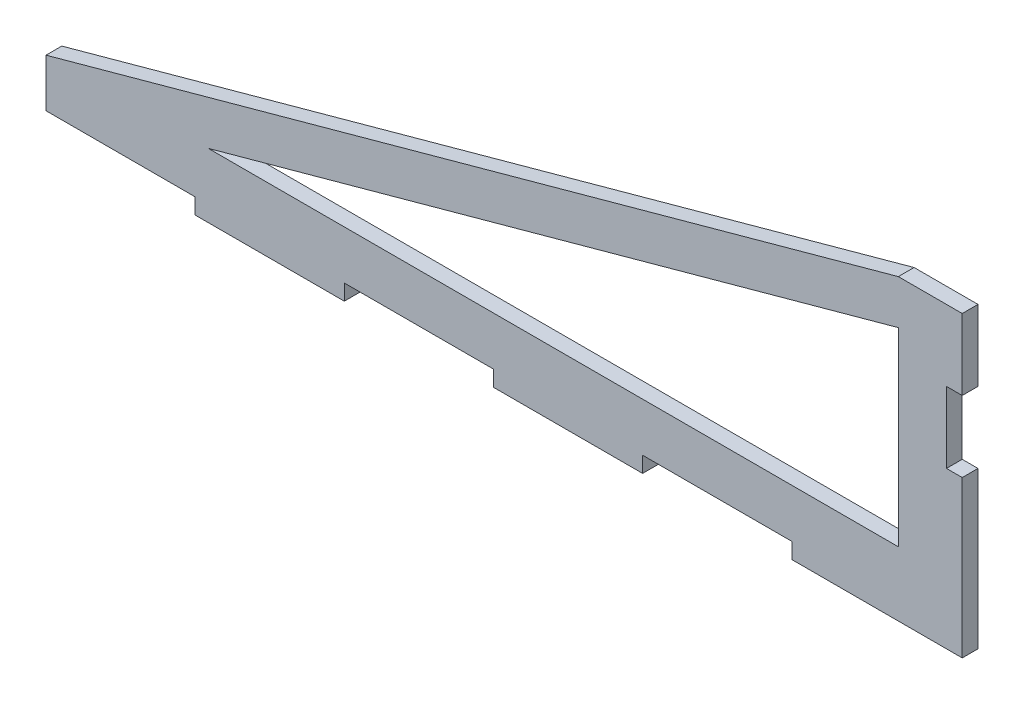
ISO-10303-21;
HEADER;
FILE_DESCRIPTION(('STEP AP214'),'2;1');
FILE_NAME('part.step','',(''),(''),'','','');
FILE_SCHEMA(('AUTOMOTIVE_DESIGN { 1 0 10303 214 1 1 1 1 }'));
ENDSEC;
DATA;
#1=APPLICATION_CONTEXT('core data for automotive mechanical design processes');
#2=APPLICATION_PROTOCOL_DEFINITION('international standard','automotive_design',2000,#1);
#3=PRODUCT_CONTEXT('',#1,'mechanical');
#4=PRODUCT('Part','Part','',(#3));
#5=PRODUCT_RELATED_PRODUCT_CATEGORY('part','',(#4));
#6=PRODUCT_DEFINITION_FORMATION('','',#4);
#7=PRODUCT_DEFINITION_CONTEXT('part definition',#1,'design');
#8=PRODUCT_DEFINITION('design','',#6,#7);
#9=PRODUCT_DEFINITION_SHAPE('','',#8);
#10=(LENGTH_UNIT() NAMED_UNIT(*) SI_UNIT(.MILLI.,.METRE.));
#11=(NAMED_UNIT(*) PLANE_ANGLE_UNIT() SI_UNIT($,.RADIAN.));
#12=(NAMED_UNIT(*) SI_UNIT($,.STERADIAN.) SOLID_ANGLE_UNIT());
#13=UNCERTAINTY_MEASURE_WITH_UNIT(LENGTH_MEASURE(1.E-05),#10,'distance_accuracy_value','');
#14=(GEOMETRIC_REPRESENTATION_CONTEXT(3) GLOBAL_UNCERTAINTY_ASSIGNED_CONTEXT((#13)) GLOBAL_UNIT_ASSIGNED_CONTEXT((#10,
#11,#12)) REPRESENTATION_CONTEXT('',''));
#15=CARTESIAN_POINT('',(0.,0.,0.));
#16=DIRECTION('',(0.,0.,1.));
#17=DIRECTION('',(1.,0.,0.));
#18=AXIS2_PLACEMENT_3D('',#15,#16,#17);
#19=CARTESIAN_POINT('',(0.,0.,4.699));
#20=DIRECTION('',(0.,0.,-1.));
#21=DIRECTION('',(-1.,0.,0.));
#22=AXIS2_PLACEMENT_3D('',#19,#20,#21);
#23=PLANE('',#22);
#24=DIRECTION('',(0.,1.,0.));
#25=VECTOR('',#24,1.);
#26=CARTESIAN_POINT('',(253.999970906423,19.1715711162676,4.699));
#27=LINE('',#26,#25);
#28=CARTESIAN_POINT('',(253.999970906423,19.1715711162676,4.699));
#29=VERTEX_POINT('',#28);
#30=CARTESIAN_POINT('',(253.999970906423,75.7285323883685,4.699));
#31=VERTEX_POINT('',#30);
#32=EDGE_CURVE('E278',#29,#31,#27,.T.);
#33=ORIENTED_EDGE('',*,*,#32,.F.);
#34=DIRECTION('',(1.,0.,0.));
#35=VECTOR('',#34,1.);
#36=CARTESIAN_POINT('',(48.3383171101548,19.1715711162676,4.699));
#37=LINE('',#36,#35);
#38=CARTESIAN_POINT('',(48.3383171101548,19.1715711162676,4.699));
#39=VERTEX_POINT('',#38);
#40=EDGE_CURVE('E284',#39,#29,#37,.T.);
#41=ORIENTED_EDGE('',*,*,#40,.F.);
#42=DIRECTION('',(-0.964205385038861,-0.265156511257149,0.));
#43=VECTOR('',#42,1.);
#44=CARTESIAN_POINT('',(48.3383171101548,19.1715711162676,4.699));
#45=LINE('',#44,#43);
#46=EDGE_CURVE('E280',#31,#39,#45,.T.);
#47=ORIENTED_EDGE('',*,*,#46,.F.);
#48=EDGE_LOOP('',(#33,#41,#47));
#49=FACE_BOUND('',#48,.T.);
#50=DIRECTION('',(1.,0.,0.));
#51=VECTOR('',#50,1.);
#52=CARTESIAN_POINT('',(268.350970906423,46.5666666666666,4.69899999999999));
#53=LINE('',#52,#51);
#54=CARTESIAN_POINT('',(268.350970906423,46.5666666666666,4.69899999999999));
#55=VERTEX_POINT('',#54);
#56=CARTESIAN_POINT('',(273.049970906423,46.5666666666666,4.69899999999999));
#57=VERTEX_POINT('',#56);
#58=EDGE_CURVE('E193',#55,#57,#53,.T.);
#59=ORIENTED_EDGE('',*,*,#58,.F.);
#60=DIRECTION('',(0.,1.,0.));
#61=VECTOR('',#60,1.);
#62=CARTESIAN_POINT('',(268.350970906423,46.5666666666666,4.69899999999999));
#63=LINE('',#62,#61);
#64=CARTESIAN_POINT('',(268.350970906423,67.7333333333333,4.69899999999999));
#65=VERTEX_POINT('',#64);
#66=EDGE_CURVE('E199',#55,#65,#63,.T.);
#67=ORIENTED_EDGE('',*,*,#66,.T.);
#68=DIRECTION('',(1.,0.,0.));
#69=VECTOR('',#68,1.);
#70=CARTESIAN_POINT('',(268.350970906423,67.7333333333333,4.69899999999999));
#71=LINE('',#70,#69);
#72=CARTESIAN_POINT('',(273.049970906423,67.7333333333333,4.69899999999999));
#73=VERTEX_POINT('',#72);
#74=EDGE_CURVE('E358',#65,#73,#71,.T.);
#75=ORIENTED_EDGE('',*,*,#74,.T.);
#76=DIRECTION('',(0.,1.,0.));
#77=VECTOR('',#76,1.);
#78=CARTESIAN_POINT('',(273.049970906423,0.,4.699));
#79=LINE('',#78,#77);
#80=CARTESIAN_POINT('',(273.049970906423,88.9,4.699));
#81=VERTEX_POINT('',#80);
#82=EDGE_CURVE('E310',#73,#81,#79,.T.);
#83=ORIENTED_EDGE('',*,*,#82,.T.);
#84=DIRECTION('',(-1.,0.,0.));
#85=VECTOR('',#84,1.);
#86=CARTESIAN_POINT('',(253.999970906423,88.9,4.699));
#87=LINE('',#86,#85);
#88=CARTESIAN_POINT('',(253.999970906423,88.9,4.699));
#89=VERTEX_POINT('',#88);
#90=EDGE_CURVE('E315',#81,#89,#87,.T.);
#91=ORIENTED_EDGE('',*,*,#90,.T.);
#92=DIRECTION('',(-0.964205385038861,-0.265156511257149,0.));
#93=VECTOR('',#92,1.);
#94=CARTESIAN_POINT('',(0.,19.05,4.699));
#95=LINE('',#94,#93);
#96=CARTESIAN_POINT('',(0.,19.05,4.699));
#97=VERTEX_POINT('',#96);
#98=EDGE_CURVE('E317',#89,#97,#95,.T.);
#99=ORIENTED_EDGE('',*,*,#98,.T.);
#100=DIRECTION('',(0.,-1.,0.));
#101=VECTOR('',#100,1.);
#102=CARTESIAN_POINT('',(0.,0.,4.699));
#103=LINE('',#102,#101);
#104=CARTESIAN_POINT('',(0.,4.699,4.699));
#105=VERTEX_POINT('',#104);
#106=EDGE_CURVE('E302',#97,#105,#103,.T.);
#107=ORIENTED_EDGE('',*,*,#106,.T.);
#108=DIRECTION('',(1.,0.,0.));
#109=VECTOR('',#108,1.);
#110=CARTESIAN_POINT('',(0.,4.699,4.699));
#111=LINE('',#110,#109);
#112=CARTESIAN_POINT('',(44.45,4.69899999999999,4.699));
#113=VERTEX_POINT('',#112);
#114=EDGE_CURVE('E260',#105,#113,#111,.T.);
#115=ORIENTED_EDGE('',*,*,#114,.T.);
#116=DIRECTION('',(0.,-1.,0.));
#117=VECTOR('',#116,1.);
#118=CARTESIAN_POINT('',(44.45,0.,4.699));
#119=LINE('',#118,#117);
#120=CARTESIAN_POINT('',(44.45,0.,4.699));
#121=VERTEX_POINT('',#120);
#122=EDGE_CURVE('E263',#113,#121,#119,.T.);
#123=ORIENTED_EDGE('',*,*,#122,.T.);
#124=DIRECTION('',(1.,0.,0.));
#125=VECTOR('',#124,1.);
#126=CARTESIAN_POINT('',(0.,0.,4.699));
#127=LINE('',#126,#125);
#128=CARTESIAN_POINT('',(88.9,0.,4.699));
#129=VERTEX_POINT('',#128);
#130=EDGE_CURVE('E307',#121,#129,#127,.T.);
#131=ORIENTED_EDGE('',*,*,#130,.T.);
#132=DIRECTION('',(0.,1.,0.));
#133=VECTOR('',#132,1.);
#134=CARTESIAN_POINT('',(88.9,0.,4.699));
#135=LINE('',#134,#133);
#136=CARTESIAN_POINT('',(88.9,4.69899999999999,4.699));
#137=VERTEX_POINT('',#136);
#138=EDGE_CURVE('E234',#129,#137,#135,.T.);
#139=ORIENTED_EDGE('',*,*,#138,.T.);
#140=DIRECTION('',(1.,0.,0.));
#141=VECTOR('',#140,1.);
#142=CARTESIAN_POINT('',(88.9,4.69899999999999,4.699));
#143=LINE('',#142,#141);
#144=CARTESIAN_POINT('',(133.35,4.69899999999998,4.699));
#145=VERTEX_POINT('',#144);
#146=EDGE_CURVE('E237',#137,#145,#143,.T.);
#147=ORIENTED_EDGE('',*,*,#146,.T.);
#148=DIRECTION('',(0.,-1.,0.));
#149=VECTOR('',#148,1.);
#150=CARTESIAN_POINT('',(133.35,0.,4.699));
#151=LINE('',#150,#149);
#152=CARTESIAN_POINT('',(133.35,0.,4.699));
#153=VERTEX_POINT('',#152);
#154=EDGE_CURVE('E241',#145,#153,#151,.T.);
#155=ORIENTED_EDGE('',*,*,#154,.T.);
#156=CARTESIAN_POINT('',(177.8,0.,4.699));
#157=VERTEX_POINT('',#156);
#158=EDGE_CURVE('E311',#153,#157,#127,.T.);
#159=ORIENTED_EDGE('',*,*,#158,.T.);
#160=DIRECTION('',(0.,1.,0.));
#161=VECTOR('',#160,1.);
#162=CARTESIAN_POINT('',(177.8,0.,4.699));
#163=LINE('',#162,#161);
#164=CARTESIAN_POINT('',(177.8,4.69899999999998,4.699));
#165=VERTEX_POINT('',#164);
#166=EDGE_CURVE('E213',#157,#165,#163,.T.);
#167=ORIENTED_EDGE('',*,*,#166,.T.);
#168=DIRECTION('',(1.,0.,0.));
#169=VECTOR('',#168,1.);
#170=CARTESIAN_POINT('',(177.8,4.69899999999998,4.699));
#171=LINE('',#170,#169);
#172=CARTESIAN_POINT('',(222.25,4.69899999999997,4.699));
#173=VERTEX_POINT('',#172);
#174=EDGE_CURVE('E216',#165,#173,#171,.T.);
#175=ORIENTED_EDGE('',*,*,#174,.T.);
#176=DIRECTION('',(0.,-1.,0.));
#177=VECTOR('',#176,1.);
#178=CARTESIAN_POINT('',(222.25,0.,4.699));
#179=LINE('',#178,#177);
#180=CARTESIAN_POINT('',(222.25,0.,4.699));
#181=VERTEX_POINT('',#180);
#182=EDGE_CURVE('E219',#173,#181,#179,.T.);
#183=ORIENTED_EDGE('',*,*,#182,.T.);
#184=CARTESIAN_POINT('',(273.049970906423,0.,4.699));
#185=VERTEX_POINT('',#184);
#186=EDGE_CURVE('E305',#181,#185,#127,.T.);
#187=ORIENTED_EDGE('',*,*,#186,.T.);
#188=EDGE_CURVE('E312',#185,#57,#79,.T.);
#189=ORIENTED_EDGE('',*,*,#188,.T.);
#190=EDGE_LOOP('',(#59,#67,#75,#83,#91,#99,#107,#115,#123,#131,#139,#147,#155,#159,#167,#175,
#183,#187,#189));
#191=FACE_BOUND('',#190,.T.);
#192=ADVANCED_FACE('F32',(#49,#191),#23,.F.);
#193=CARTESIAN_POINT('',(273.049970906423,58.6849875691359,4.699));
#194=DIRECTION('',(-1.,0.,0.));
#195=DIRECTION('',(0.,-1.,0.));
#196=AXIS2_PLACEMENT_3D('',#193,#194,#195);
#197=PLANE('',#196);
#198=DIRECTION('',(0.,0.,1.));
#199=VECTOR('',#198,1.);
#200=CARTESIAN_POINT('',(273.049970906423,46.5666666666666,0.));
#201=LINE('',#200,#199);
#202=CARTESIAN_POINT('',(273.049970906423,46.5666666666666,0.));
#203=VERTEX_POINT('',#202);
#204=EDGE_CURVE('E188',#203,#57,#201,.T.);
#205=ORIENTED_EDGE('',*,*,#204,.T.);
#206=ORIENTED_EDGE('',*,*,#188,.F.);
#207=DIRECTION('',(0.,0.,-1.));
#208=VECTOR('',#207,1.);
#209=CARTESIAN_POINT('',(273.049970906423,0.,4.699));
#210=LINE('',#209,#208);
#211=CARTESIAN_POINT('',(273.049970906423,0.,0.));
#212=VERTEX_POINT('',#211);
#213=EDGE_CURVE('E11',#185,#212,#210,.T.);
#214=ORIENTED_EDGE('',*,*,#213,.T.);
#215=DIRECTION('',(0.,1.,0.));
#216=VECTOR('',#215,1.);
#217=CARTESIAN_POINT('',(273.049970906423,58.6849875691359,0.));
#218=LINE('',#217,#216);
#219=EDGE_CURVE('E328',#212,#203,#218,.T.);
#220=ORIENTED_EDGE('',*,*,#219,.T.);
#221=EDGE_LOOP('',(#205,#206,#214,#220));
#222=FACE_BOUND('',#221,.T.);
#223=ADVANCED_FACE('F368',(#222),#197,.F.);
#224=DIRECTION('',(0.,0.,-1.));
#225=VECTOR('',#224,1.);
#226=CARTESIAN_POINT('',(273.049970906423,67.7333333333333,0.));
#227=LINE('',#226,#225);
#228=CARTESIAN_POINT('',(273.049970906423,67.7333333333333,0.));
#229=VERTEX_POINT('',#228);
#230=EDGE_CURVE('E201',#73,#229,#227,.T.);
#231=ORIENTED_EDGE('',*,*,#230,.T.);
#232=CARTESIAN_POINT('',(273.049970906423,88.9,0.));
#233=VERTEX_POINT('',#232);
#234=EDGE_CURVE('E326',#229,#233,#218,.T.);
#235=ORIENTED_EDGE('',*,*,#234,.T.);
#236=DIRECTION('',(0.,0.,-1.));
#237=VECTOR('',#236,1.);
#238=CARTESIAN_POINT('',(273.049970906423,88.9,4.699));
#239=LINE('',#238,#237);
#240=EDGE_CURVE('E40',#81,#233,#239,.T.);
#241=ORIENTED_EDGE('',*,*,#240,.F.);
#242=ORIENTED_EDGE('',*,*,#82,.F.);
#243=EDGE_LOOP('',(#231,#235,#241,#242));
#244=FACE_BOUND('',#243,.T.);
#245=ADVANCED_FACE('F359',(#244),#197,.F.);
#246=CARTESIAN_POINT('',(0.,0.,4.699));
#247=DIRECTION('',(0.,1.,0.));
#248=DIRECTION('',(0.,0.,1.));
#249=AXIS2_PLACEMENT_3D('',#246,#247,#248);
#250=PLANE('',#249);
#251=DIRECTION('',(1.,0.,0.));
#252=VECTOR('',#251,1.);
#253=CARTESIAN_POINT('',(0.,0.,0.));
#254=LINE('',#253,#252);
#255=CARTESIAN_POINT('',(133.35,0.,0.));
#256=VERTEX_POINT('',#255);
#257=CARTESIAN_POINT('',(177.8,0.,0.));
#258=VERTEX_POINT('',#257);
#259=EDGE_CURVE('E327',#256,#258,#254,.T.);
#260=ORIENTED_EDGE('',*,*,#259,.T.);
#261=DIRECTION('',(0.,0.,-1.));
#262=VECTOR('',#261,1.);
#263=CARTESIAN_POINT('',(177.8,0.,4.699));
#264=LINE('',#263,#262);
#265=EDGE_CURVE('E226',#157,#258,#264,.T.);
#266=ORIENTED_EDGE('',*,*,#265,.F.);
#267=ORIENTED_EDGE('',*,*,#158,.F.);
#268=DIRECTION('',(0.,0.,-1.));
#269=VECTOR('',#268,1.);
#270=CARTESIAN_POINT('',(133.35,0.,4.699));
#271=LINE('',#270,#269);
#272=EDGE_CURVE('E254',#153,#256,#271,.T.);
#273=ORIENTED_EDGE('',*,*,#272,.T.);
#274=EDGE_LOOP('',(#260,#266,#267,#273));
#275=FACE_BOUND('',#274,.T.);
#276=ADVANCED_FACE('F379',(#275),#250,.F.);
#277=CARTESIAN_POINT('',(44.45,0.,0.));
#278=VERTEX_POINT('',#277);
#279=CARTESIAN_POINT('',(88.9,0.,0.));
#280=VERTEX_POINT('',#279);
#281=EDGE_CURVE('E323',#278,#280,#254,.T.);
#282=ORIENTED_EDGE('',*,*,#281,.T.);
#283=DIRECTION('',(0.,0.,-1.));
#284=VECTOR('',#283,1.);
#285=CARTESIAN_POINT('',(88.9,0.,4.699));
#286=LINE('',#285,#284);
#287=EDGE_CURVE('E251',#129,#280,#286,.T.);
#288=ORIENTED_EDGE('',*,*,#287,.F.);
#289=ORIENTED_EDGE('',*,*,#130,.F.);
#290=DIRECTION('',(0.,0.,-1.));
#291=VECTOR('',#290,1.);
#292=CARTESIAN_POINT('',(44.45,0.,4.699));
#293=LINE('',#292,#291);
#294=EDGE_CURVE('E271',#121,#278,#293,.T.);
#295=ORIENTED_EDGE('',*,*,#294,.T.);
#296=EDGE_LOOP('',(#282,#288,#289,#295));
#297=FACE_BOUND('',#296,.T.);
#298=ADVANCED_FACE('F401',(#297),#250,.F.);
#299=CARTESIAN_POINT('',(0.,0.,0.));
#300=DIRECTION('',(0.,0.,-1.));
#301=DIRECTION('',(-1.,0.,0.));
#302=AXIS2_PLACEMENT_3D('',#299,#300,#301);
#303=PLANE('',#302);
#304=DIRECTION('',(0.,1.,0.));
#305=VECTOR('',#304,1.);
#306=CARTESIAN_POINT('',(268.350970906423,0.,0.));
#307=LINE('',#306,#305);
#308=CARTESIAN_POINT('',(268.350970906423,46.5666666666666,0.));
#309=VERTEX_POINT('',#308);
#310=CARTESIAN_POINT('',(268.350970906423,67.7333333333333,0.));
#311=VERTEX_POINT('',#310);
#312=EDGE_CURVE('E192',#309,#311,#307,.T.);
#313=ORIENTED_EDGE('',*,*,#312,.F.);
#314=DIRECTION('',(1.,0.,0.));
#315=VECTOR('',#314,1.);
#316=CARTESIAN_POINT('',(268.350970906423,46.5666666666666,0.));
#317=LINE('',#316,#315);
#318=EDGE_CURVE('E182',#309,#203,#317,.T.);
#319=ORIENTED_EDGE('',*,*,#318,.T.);
#320=ORIENTED_EDGE('',*,*,#219,.F.);
#321=CARTESIAN_POINT('',(222.25,0.,0.));
#322=VERTEX_POINT('',#321);
#323=EDGE_CURVE('E322',#322,#212,#254,.T.);
#324=ORIENTED_EDGE('',*,*,#323,.F.);
#325=DIRECTION('',(0.,-1.,0.));
#326=VECTOR('',#325,1.);
#327=CARTESIAN_POINT('',(222.25,0.,0.));
#328=LINE('',#327,#326);
#329=CARTESIAN_POINT('',(222.25,4.69899999999997,0.));
#330=VERTEX_POINT('',#329);
#331=EDGE_CURVE('E55',#330,#322,#328,.T.);
#332=ORIENTED_EDGE('',*,*,#331,.F.);
#333=DIRECTION('',(1.,0.,0.));
#334=VECTOR('',#333,1.);
#335=CARTESIAN_POINT('',(177.8,4.69899999999998,0.));
#336=LINE('',#335,#334);
#337=CARTESIAN_POINT('',(177.8,4.69899999999998,0.));
#338=VERTEX_POINT('',#337);
#339=EDGE_CURVE('E209',#338,#330,#336,.T.);
#340=ORIENTED_EDGE('',*,*,#339,.F.);
#341=DIRECTION('',(0.,1.,0.));
#342=VECTOR('',#341,1.);
#343=CARTESIAN_POINT('',(177.8,0.,0.));
#344=LINE('',#343,#342);
#345=EDGE_CURVE('E206',#258,#338,#344,.T.);
#346=ORIENTED_EDGE('',*,*,#345,.F.);
#347=ORIENTED_EDGE('',*,*,#259,.F.);
#348=DIRECTION('',(0.,-1.,0.));
#349=VECTOR('',#348,1.);
#350=CARTESIAN_POINT('',(133.35,0.,0.));
#351=LINE('',#350,#349);
#352=CARTESIAN_POINT('',(133.35,4.69899999999998,0.));
#353=VERTEX_POINT('',#352);
#354=EDGE_CURVE('E238',#353,#256,#351,.T.);
#355=ORIENTED_EDGE('',*,*,#354,.F.);
#356=DIRECTION('',(1.,0.,0.));
#357=VECTOR('',#356,1.);
#358=CARTESIAN_POINT('',(88.9,4.69899999999999,0.));
#359=LINE('',#358,#357);
#360=CARTESIAN_POINT('',(88.9,4.69899999999999,0.));
#361=VERTEX_POINT('',#360);
#362=EDGE_CURVE('E247',#361,#353,#359,.T.);
#363=ORIENTED_EDGE('',*,*,#362,.F.);
#364=DIRECTION('',(0.,1.,0.));
#365=VECTOR('',#364,1.);
#366=CARTESIAN_POINT('',(88.9,0.,0.));
#367=LINE('',#366,#365);
#368=EDGE_CURVE('E228',#280,#361,#367,.T.);
#369=ORIENTED_EDGE('',*,*,#368,.F.);
#370=ORIENTED_EDGE('',*,*,#281,.F.);
#371=DIRECTION('',(0.,-1.,0.));
#372=VECTOR('',#371,1.);
#373=CARTESIAN_POINT('',(44.45,0.,0.));
#374=LINE('',#373,#372);
#375=CARTESIAN_POINT('',(44.45,4.69899999999999,0.));
#376=VERTEX_POINT('',#375);
#377=EDGE_CURVE('E264',#376,#278,#374,.T.);
#378=ORIENTED_EDGE('',*,*,#377,.F.);
#379=DIRECTION('',(1.,0.,0.));
#380=VECTOR('',#379,1.);
#381=CARTESIAN_POINT('',(0.,4.699,0.));
#382=LINE('',#381,#380);
#383=CARTESIAN_POINT('',(0.,4.699,0.));
#384=VERTEX_POINT('',#383);
#385=EDGE_CURVE('E253',#384,#376,#382,.T.);
#386=ORIENTED_EDGE('',*,*,#385,.F.);
#387=DIRECTION('',(0.,-1.,0.));
#388=VECTOR('',#387,1.);
#389=CARTESIAN_POINT('',(0.,0.,0.));
#390=LINE('',#389,#388);
#391=CARTESIAN_POINT('',(0.,19.05,0.));
#392=VERTEX_POINT('',#391);
#393=EDGE_CURVE('E301',#392,#384,#390,.T.);
#394=ORIENTED_EDGE('',*,*,#393,.F.);
#395=DIRECTION('',(-0.964205385038861,-0.265156511257149,0.));
#396=VECTOR('',#395,1.);
#397=CARTESIAN_POINT('',(0.,19.05,0.));
#398=LINE('',#397,#396);
#399=CARTESIAN_POINT('',(253.999970906423,88.9,0.));
#400=VERTEX_POINT('',#399);
#401=EDGE_CURVE('E306',#400,#392,#398,.T.);
#402=ORIENTED_EDGE('',*,*,#401,.F.);
#403=DIRECTION('',(-1.,0.,0.));
#404=VECTOR('',#403,1.);
#405=CARTESIAN_POINT('',(253.999970906423,88.9,0.));
#406=LINE('',#405,#404);
#407=EDGE_CURVE('E330',#233,#400,#406,.T.);
#408=ORIENTED_EDGE('',*,*,#407,.F.);
#409=ORIENTED_EDGE('',*,*,#234,.F.);
#410=DIRECTION('',(1.,0.,0.));
#411=VECTOR('',#410,1.);
#412=CARTESIAN_POINT('',(268.350970906423,67.7333333333333,0.));
#413=LINE('',#412,#411);
#414=EDGE_CURVE('E47',#311,#229,#413,.T.);
#415=ORIENTED_EDGE('',*,*,#414,.F.);
#416=EDGE_LOOP('',(#313,#319,#320,#324,#332,#340,#346,#347,#355,#363,#369,#370,#378,#386,#394,
#402,#408,#409,#415));
#417=FACE_BOUND('',#416,.T.);
#418=DIRECTION('',(1.,0.,0.));
#419=VECTOR('',#418,1.);
#420=CARTESIAN_POINT('',(48.3383171101548,19.1715711162676,0.));
#421=LINE('',#420,#419);
#422=CARTESIAN_POINT('',(48.3383171101548,19.1715711162676,0.));
#423=VERTEX_POINT('',#422);
#424=CARTESIAN_POINT('',(253.999970906423,19.1715711162676,0.));
#425=VERTEX_POINT('',#424);
#426=EDGE_CURVE('E281',#423,#425,#421,.T.);
#427=ORIENTED_EDGE('',*,*,#426,.T.);
#428=DIRECTION('',(0.,1.,0.));
#429=VECTOR('',#428,1.);
#430=CARTESIAN_POINT('',(253.999970906423,19.1715711162676,0.));
#431=LINE('',#430,#429);
#432=CARTESIAN_POINT('',(253.999970906423,75.7285323883685,0.));
#433=VERTEX_POINT('',#432);
#434=EDGE_CURVE('E274',#425,#433,#431,.T.);
#435=ORIENTED_EDGE('',*,*,#434,.T.);
#436=DIRECTION('',(-0.964205385038861,-0.265156511257149,0.));
#437=VECTOR('',#436,1.);
#438=CARTESIAN_POINT('',(48.3383171101548,19.1715711162676,0.));
#439=LINE('',#438,#437);
#440=EDGE_CURVE('E289',#433,#423,#439,.T.);
#441=ORIENTED_EDGE('',*,*,#440,.T.);
#442=EDGE_LOOP('',(#427,#435,#441));
#443=FACE_BOUND('',#442,.T.);
#444=ADVANCED_FACE('F203',(#417,#443),#303,.T.);
#445=CARTESIAN_POINT('',(0.,0.,4.699));
#446=DIRECTION('',(1.,0.,0.));
#447=DIRECTION('',(0.,0.,-1.));
#448=AXIS2_PLACEMENT_3D('',#445,#446,#447);
#449=PLANE('',#448);
#450=ORIENTED_EDGE('',*,*,#393,.T.);
#451=DIRECTION('',(0.,0.,-1.));
#452=VECTOR('',#451,1.);
#453=CARTESIAN_POINT('',(0.,4.699,4.699));
#454=LINE('',#453,#452);
#455=EDGE_CURVE('E267',#105,#384,#454,.T.);
#456=ORIENTED_EDGE('',*,*,#455,.F.);
#457=ORIENTED_EDGE('',*,*,#106,.F.);
#458=DIRECTION('',(0.,0.,-1.));
#459=VECTOR('',#458,1.);
#460=CARTESIAN_POINT('',(0.,19.05,4.699));
#461=LINE('',#460,#459);
#462=EDGE_CURVE('E319',#97,#392,#461,.T.);
#463=ORIENTED_EDGE('',*,*,#462,.T.);
#464=EDGE_LOOP('',(#450,#456,#457,#463));
#465=FACE_BOUND('',#464,.T.);
#466=ADVANCED_FACE('F34',(#465),#449,.F.);
#467=ORIENTED_EDGE('',*,*,#186,.F.);
#468=DIRECTION('',(0.,0.,-1.));
#469=VECTOR('',#468,1.);
#470=CARTESIAN_POINT('',(222.25,0.,4.699));
#471=LINE('',#470,#469);
#472=EDGE_CURVE('E229',#181,#322,#471,.T.);
#473=ORIENTED_EDGE('',*,*,#472,.T.);
#474=ORIENTED_EDGE('',*,*,#323,.T.);
#475=ORIENTED_EDGE('',*,*,#213,.F.);
#476=EDGE_LOOP('',(#467,#473,#474,#475));
#477=FACE_BOUND('',#476,.T.);
#478=ADVANCED_FACE('F373',(#477),#250,.F.);
#479=CARTESIAN_POINT('',(253.999970906423,88.9,4.699));
#480=DIRECTION('',(0.,-1.,0.));
#481=DIRECTION('',(0.,0.,-1.));
#482=AXIS2_PLACEMENT_3D('',#479,#480,#481);
#483=PLANE('',#482);
#484=ORIENTED_EDGE('',*,*,#407,.T.);
#485=DIRECTION('',(0.,0.,-1.));
#486=VECTOR('',#485,1.);
#487=CARTESIAN_POINT('',(253.999970906423,88.9,4.699));
#488=LINE('',#487,#486);
#489=EDGE_CURVE('E335',#89,#400,#488,.T.);
#490=ORIENTED_EDGE('',*,*,#489,.F.);
#491=ORIENTED_EDGE('',*,*,#90,.F.);
#492=ORIENTED_EDGE('',*,*,#240,.T.);
#493=EDGE_LOOP('',(#484,#490,#491,#492));
#494=FACE_BOUND('',#493,.T.);
#495=ADVANCED_FACE('F342',(#494),#483,.F.);
#496=CARTESIAN_POINT('',(0.,19.05,4.699));
#497=DIRECTION('',(0.265156511257149,-0.964205385038861,0.));
#498=DIRECTION('',(0.964205385038861,0.265156511257149,0.));
#499=AXIS2_PLACEMENT_3D('',#496,#497,#498);
#500=PLANE('',#499);
#501=ORIENTED_EDGE('',*,*,#401,.T.);
#502=ORIENTED_EDGE('',*,*,#462,.F.);
#503=ORIENTED_EDGE('',*,*,#98,.F.);
#504=ORIENTED_EDGE('',*,*,#489,.T.);
#505=EDGE_LOOP('',(#501,#502,#503,#504));
#506=FACE_BOUND('',#505,.T.);
#507=ADVANCED_FACE('F351',(#506),#500,.F.);
#508=CARTESIAN_POINT('',(253.999970906423,19.1715711162676,4.699));
#509=DIRECTION('',(-1.,0.,0.));
#510=DIRECTION('',(0.,-1.,0.));
#511=AXIS2_PLACEMENT_3D('',#508,#509,#510);
#512=PLANE('',#511);
#513=ORIENTED_EDGE('',*,*,#434,.F.);
#514=DIRECTION('',(0.,0.,-1.));
#515=VECTOR('',#514,1.);
#516=CARTESIAN_POINT('',(253.999970906423,19.1715711162676,4.699));
#517=LINE('',#516,#515);
#518=EDGE_CURVE('E286',#29,#425,#517,.T.);
#519=ORIENTED_EDGE('',*,*,#518,.F.);
#520=ORIENTED_EDGE('',*,*,#32,.T.);
#521=DIRECTION('',(0.,0.,-1.));
#522=VECTOR('',#521,1.);
#523=CARTESIAN_POINT('',(253.999970906423,75.7285323883685,4.699));
#524=LINE('',#523,#522);
#525=EDGE_CURVE('E298',#31,#433,#524,.T.);
#526=ORIENTED_EDGE('',*,*,#525,.T.);
#527=EDGE_LOOP('',(#513,#519,#520,#526));
#528=FACE_BOUND('',#527,.T.);
#529=ADVANCED_FACE('F430',(#528),#512,.T.);
#530=CARTESIAN_POINT('',(48.3383171101548,19.1715711162676,4.699));
#531=DIRECTION('',(0.265156511257149,-0.964205385038861,0.));
#532=DIRECTION('',(0.964205385038861,0.265156511257149,0.));
#533=AXIS2_PLACEMENT_3D('',#530,#531,#532);
#534=PLANE('',#533);
#535=ORIENTED_EDGE('',*,*,#440,.F.);
#536=ORIENTED_EDGE('',*,*,#525,.F.);
#537=ORIENTED_EDGE('',*,*,#46,.T.);
#538=DIRECTION('',(0.,0.,-1.));
#539=VECTOR('',#538,1.);
#540=CARTESIAN_POINT('',(48.3383171101548,19.1715711162676,4.699));
#541=LINE('',#540,#539);
#542=EDGE_CURVE('E296',#39,#423,#541,.T.);
#543=ORIENTED_EDGE('',*,*,#542,.T.);
#544=EDGE_LOOP('',(#535,#536,#537,#543));
#545=FACE_BOUND('',#544,.T.);
#546=ADVANCED_FACE('F590',(#545),#534,.T.);
#547=CARTESIAN_POINT('',(48.3383171101548,19.1715711162676,4.699));
#548=DIRECTION('',(0.,1.,0.));
#549=DIRECTION('',(0.,0.,1.));
#550=AXIS2_PLACEMENT_3D('',#547,#548,#549);
#551=PLANE('',#550);
#552=ORIENTED_EDGE('',*,*,#426,.F.);
#553=ORIENTED_EDGE('',*,*,#542,.F.);
#554=ORIENTED_EDGE('',*,*,#40,.T.);
#555=ORIENTED_EDGE('',*,*,#518,.T.);
#556=EDGE_LOOP('',(#552,#553,#554,#555));
#557=FACE_BOUND('',#556,.T.);
#558=ADVANCED_FACE('F472',(#557),#551,.T.);
#559=CARTESIAN_POINT('',(44.45,0.,4.699));
#560=DIRECTION('',(1.,0.,0.));
#561=DIRECTION('',(0.,0.,-1.));
#562=AXIS2_PLACEMENT_3D('',#559,#560,#561);
#563=PLANE('',#562);
#564=ORIENTED_EDGE('',*,*,#377,.T.);
#565=ORIENTED_EDGE('',*,*,#294,.F.);
#566=ORIENTED_EDGE('',*,*,#122,.F.);
#567=DIRECTION('',(0.,0.,-1.));
#568=VECTOR('',#567,1.);
#569=CARTESIAN_POINT('',(44.45,4.69899999999999,4.699));
#570=LINE('',#569,#568);
#571=EDGE_CURVE('E275',#113,#376,#570,.T.);
#572=ORIENTED_EDGE('',*,*,#571,.T.);
#573=EDGE_LOOP('',(#564,#565,#566,#572));
#574=FACE_BOUND('',#573,.T.);
#575=ADVANCED_FACE('F405',(#574),#563,.F.);
#576=CARTESIAN_POINT('',(0.,4.699,4.699));
#577=DIRECTION('',(0.,1.,0.));
#578=DIRECTION('',(-1.,0.,0.));
#579=AXIS2_PLACEMENT_3D('',#576,#577,#578);
#580=PLANE('',#579);
#581=ORIENTED_EDGE('',*,*,#385,.T.);
#582=ORIENTED_EDGE('',*,*,#571,.F.);
#583=ORIENTED_EDGE('',*,*,#114,.F.);
#584=ORIENTED_EDGE('',*,*,#455,.T.);
#585=EDGE_LOOP('',(#581,#582,#583,#584));
#586=FACE_BOUND('',#585,.T.);
#587=ADVANCED_FACE('F408',(#586),#580,.F.);
#588=CARTESIAN_POINT('',(88.9,0.,4.699));
#589=DIRECTION('',(-1.,0.,0.));
#590=DIRECTION('',(0.,-1.,0.));
#591=AXIS2_PLACEMENT_3D('',#588,#589,#590);
#592=PLANE('',#591);
#593=ORIENTED_EDGE('',*,*,#368,.T.);
#594=DIRECTION('',(0.,0.,-1.));
#595=VECTOR('',#594,1.);
#596=CARTESIAN_POINT('',(88.9,4.69899999999999,4.699));
#597=LINE('',#596,#595);
#598=EDGE_CURVE('E244',#137,#361,#597,.T.);
#599=ORIENTED_EDGE('',*,*,#598,.F.);
#600=ORIENTED_EDGE('',*,*,#138,.F.);
#601=ORIENTED_EDGE('',*,*,#287,.T.);
#602=EDGE_LOOP('',(#593,#599,#600,#601));
#603=FACE_BOUND('',#602,.T.);
#604=ADVANCED_FACE('F406',(#603),#592,.F.);
#605=CARTESIAN_POINT('',(133.35,0.,4.699));
#606=DIRECTION('',(1.,0.,0.));
#607=DIRECTION('',(0.,0.,-1.));
#608=AXIS2_PLACEMENT_3D('',#605,#606,#607);
#609=PLANE('',#608);
#610=ORIENTED_EDGE('',*,*,#354,.T.);
#611=ORIENTED_EDGE('',*,*,#272,.F.);
#612=ORIENTED_EDGE('',*,*,#154,.F.);
#613=DIRECTION('',(0.,0.,-1.));
#614=VECTOR('',#613,1.);
#615=CARTESIAN_POINT('',(133.35,4.69899999999998,4.699));
#616=LINE('',#615,#614);
#617=EDGE_CURVE('E257',#145,#353,#616,.T.);
#618=ORIENTED_EDGE('',*,*,#617,.T.);
#619=EDGE_LOOP('',(#610,#611,#612,#618));
#620=FACE_BOUND('',#619,.T.);
#621=ADVANCED_FACE('F392',(#620),#609,.F.);
#622=CARTESIAN_POINT('',(88.9,4.69899999999999,4.699));
#623=DIRECTION('',(0.,1.,0.));
#624=DIRECTION('',(-1.,0.,0.));
#625=AXIS2_PLACEMENT_3D('',#622,#623,#624);
#626=PLANE('',#625);
#627=ORIENTED_EDGE('',*,*,#362,.T.);
#628=ORIENTED_EDGE('',*,*,#617,.F.);
#629=ORIENTED_EDGE('',*,*,#146,.F.);
#630=ORIENTED_EDGE('',*,*,#598,.T.);
#631=EDGE_LOOP('',(#627,#628,#629,#630));
#632=FACE_BOUND('',#631,.T.);
#633=ADVANCED_FACE('F394',(#632),#626,.F.);
#634=CARTESIAN_POINT('',(177.8,0.,4.699));
#635=DIRECTION('',(-1.,0.,0.));
#636=DIRECTION('',(0.,0.,1.));
#637=AXIS2_PLACEMENT_3D('',#634,#635,#636);
#638=PLANE('',#637);
#639=ORIENTED_EDGE('',*,*,#345,.T.);
#640=DIRECTION('',(0.,0.,-1.));
#641=VECTOR('',#640,1.);
#642=CARTESIAN_POINT('',(177.8,4.69899999999998,4.699));
#643=LINE('',#642,#641);
#644=EDGE_CURVE('E221',#165,#338,#643,.T.);
#645=ORIENTED_EDGE('',*,*,#644,.F.);
#646=ORIENTED_EDGE('',*,*,#166,.F.);
#647=ORIENTED_EDGE('',*,*,#265,.T.);
#648=EDGE_LOOP('',(#639,#645,#646,#647));
#649=FACE_BOUND('',#648,.T.);
#650=ADVANCED_FACE('F387',(#649),#638,.F.);
#651=CARTESIAN_POINT('',(222.25,0.,4.699));
#652=DIRECTION('',(1.,0.,0.));
#653=DIRECTION('',(0.,0.,-1.));
#654=AXIS2_PLACEMENT_3D('',#651,#652,#653);
#655=PLANE('',#654);
#656=ORIENTED_EDGE('',*,*,#331,.T.);
#657=ORIENTED_EDGE('',*,*,#472,.F.);
#658=ORIENTED_EDGE('',*,*,#182,.F.);
#659=DIRECTION('',(0.,0.,-1.));
#660=VECTOR('',#659,1.);
#661=CARTESIAN_POINT('',(222.25,4.69899999999997,4.699));
#662=LINE('',#661,#660);
#663=EDGE_CURVE('E231',#173,#330,#662,.T.);
#664=ORIENTED_EDGE('',*,*,#663,.T.);
#665=EDGE_LOOP('',(#656,#657,#658,#664));
#666=FACE_BOUND('',#665,.T.);
#667=ADVANCED_FACE('F505',(#666),#655,.F.);
#668=CARTESIAN_POINT('',(177.8,4.69899999999998,4.699));
#669=DIRECTION('',(0.,1.,0.));
#670=DIRECTION('',(-1.,0.,0.));
#671=AXIS2_PLACEMENT_3D('',#668,#669,#670);
#672=PLANE('',#671);
#673=ORIENTED_EDGE('',*,*,#339,.T.);
#674=ORIENTED_EDGE('',*,*,#663,.F.);
#675=ORIENTED_EDGE('',*,*,#174,.F.);
#676=ORIENTED_EDGE('',*,*,#644,.T.);
#677=EDGE_LOOP('',(#673,#674,#675,#676));
#678=FACE_BOUND('',#677,.T.);
#679=ADVANCED_FACE('F514',(#678),#672,.F.);
#680=CARTESIAN_POINT('',(268.350970906423,88.9,0.));
#681=DIRECTION('',(-1.,0.,0.));
#682=DIRECTION('',(0.,0.,-1.));
#683=AXIS2_PLACEMENT_3D('',#680,#681,#682);
#684=PLANE('',#683);
#685=ORIENTED_EDGE('',*,*,#312,.T.);
#686=DIRECTION('',(0.,0.,-1.));
#687=VECTOR('',#686,1.);
#688=CARTESIAN_POINT('',(268.350970906423,67.7333333333333,0.));
#689=LINE('',#688,#687);
#690=EDGE_CURVE('E365',#65,#311,#689,.T.);
#691=ORIENTED_EDGE('',*,*,#690,.F.);
#692=ORIENTED_EDGE('',*,*,#66,.F.);
#693=DIRECTION('',(0.,0.,1.));
#694=VECTOR('',#693,1.);
#695=CARTESIAN_POINT('',(268.350970906423,46.5666666666666,0.));
#696=LINE('',#695,#694);
#697=EDGE_CURVE('E185',#309,#55,#696,.T.);
#698=ORIENTED_EDGE('',*,*,#697,.F.);
#699=EDGE_LOOP('',(#685,#691,#692,#698));
#700=FACE_BOUND('',#699,.T.);
#701=ADVANCED_FACE('F196',(#700),#684,.F.);
#702=CARTESIAN_POINT('',(268.350970906423,46.5666666666666,0.));
#703=DIRECTION('',(0.,1.,0.));
#704=DIRECTION('',(0.,0.,-1.));
#705=AXIS2_PLACEMENT_3D('',#702,#703,#704);
#706=PLANE('',#705);
#707=ORIENTED_EDGE('',*,*,#204,.F.);
#708=ORIENTED_EDGE('',*,*,#318,.F.);
#709=ORIENTED_EDGE('',*,*,#697,.T.);
#710=ORIENTED_EDGE('',*,*,#58,.T.);
#711=EDGE_LOOP('',(#707,#708,#709,#710));
#712=FACE_BOUND('',#711,.T.);
#713=ADVANCED_FACE('F184',(#712),#706,.T.);
#714=CARTESIAN_POINT('',(268.350970906423,67.7333333333333,0.));
#715=DIRECTION('',(0.,-1.,0.));
#716=DIRECTION('',(-1.,0.,0.));
#717=AXIS2_PLACEMENT_3D('',#714,#715,#716);
#718=PLANE('',#717);
#719=ORIENTED_EDGE('',*,*,#230,.F.);
#720=ORIENTED_EDGE('',*,*,#74,.F.);
#721=ORIENTED_EDGE('',*,*,#690,.T.);
#722=ORIENTED_EDGE('',*,*,#414,.T.);
#723=EDGE_LOOP('',(#719,#720,#721,#722));
#724=FACE_BOUND('',#723,.T.);
#725=ADVANCED_FACE('F568',(#724),#718,.T.);
#726=CLOSED_SHELL('',(#192,#223,#245,#276,#298,#444,#466,#478,#495,#507,#529,#546,#558,#575,
#587,#604,#621,#633,#650,#667,#679,#701,#713,#725));
#727=MANIFOLD_SOLID_BREP('B2',#726);
#728=ADVANCED_BREP_SHAPE_REPRESENTATION('',(#18,#727),#14);
#729=SHAPE_DEFINITION_REPRESENTATION(#9,#728);
ENDSEC;
END-ISO-10303-21;
